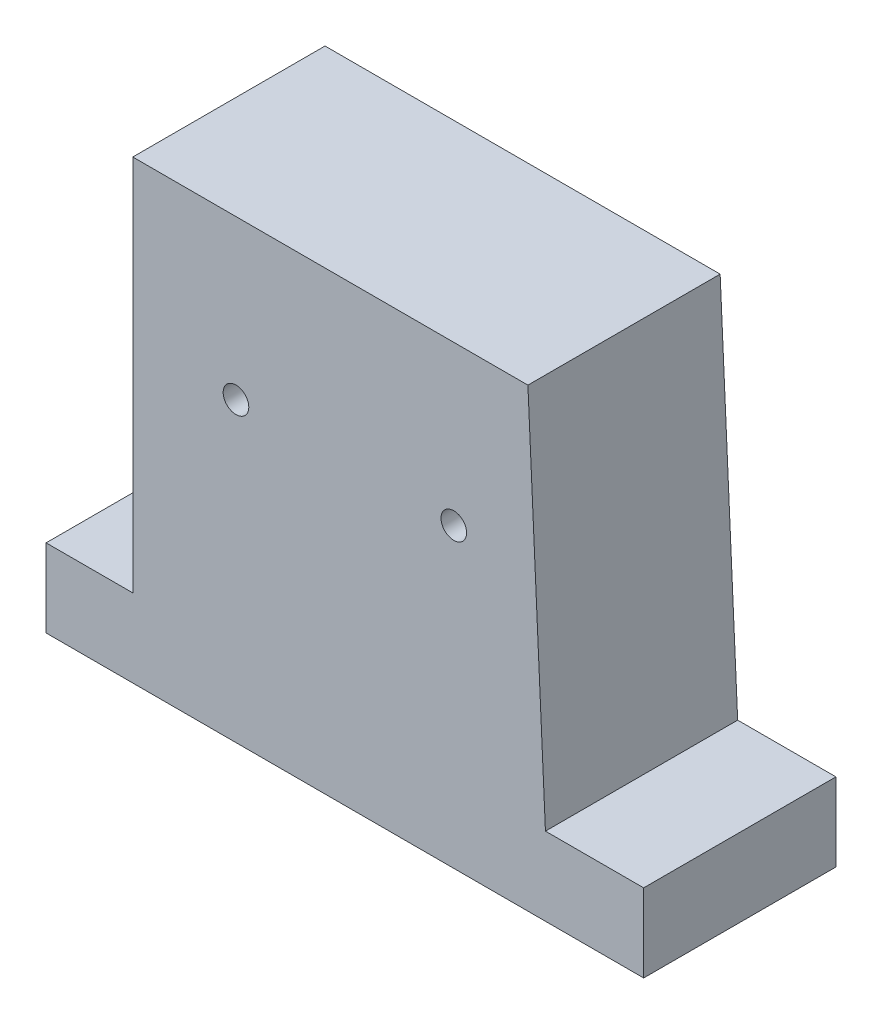
ISO-10303-21;
HEADER;
FILE_DESCRIPTION(('STEP AP214'),'2;1');
FILE_NAME('part.step','',(''),(''),'','','');
FILE_SCHEMA(('AUTOMOTIVE_DESIGN { 1 0 10303 214 1 1 1 1 }'));
ENDSEC;
DATA;
#1=APPLICATION_CONTEXT('core data for automotive mechanical design processes');
#2=APPLICATION_PROTOCOL_DEFINITION('international standard','automotive_design',2000,#1);
#3=PRODUCT_CONTEXT('',#1,'mechanical');
#4=PRODUCT('Part','Part','',(#3));
#5=PRODUCT_RELATED_PRODUCT_CATEGORY('part','',(#4));
#6=PRODUCT_DEFINITION_FORMATION('','',#4);
#7=PRODUCT_DEFINITION_CONTEXT('part definition',#1,'design');
#8=PRODUCT_DEFINITION('design','',#6,#7);
#9=PRODUCT_DEFINITION_SHAPE('','',#8);
#10=(LENGTH_UNIT() NAMED_UNIT(*) SI_UNIT(.MILLI.,.METRE.));
#11=(NAMED_UNIT(*) PLANE_ANGLE_UNIT() SI_UNIT($,.RADIAN.));
#12=(NAMED_UNIT(*) SI_UNIT($,.STERADIAN.) SOLID_ANGLE_UNIT());
#13=UNCERTAINTY_MEASURE_WITH_UNIT(LENGTH_MEASURE(1.E-05),#10,'distance_accuracy_value','');
#14=(GEOMETRIC_REPRESENTATION_CONTEXT(3) GLOBAL_UNCERTAINTY_ASSIGNED_CONTEXT((#13)) GLOBAL_UNIT_ASSIGNED_CONTEXT((#10,
#11,#12)) REPRESENTATION_CONTEXT('',''));
#15=CARTESIAN_POINT('',(0.,0.,0.));
#16=DIRECTION('',(0.,0.,1.));
#17=DIRECTION('',(1.,0.,0.));
#18=AXIS2_PLACEMENT_3D('',#15,#16,#17);
#19=CARTESIAN_POINT('',(0.,0.,60.));
#20=DIRECTION('',(0.,0.,-1.));
#21=DIRECTION('',(-1.,0.,0.));
#22=AXIS2_PLACEMENT_3D('',#19,#20,#21);
#23=PLANE('',#22);
#24=DIRECTION('',(1.,0.,0.));
#25=VECTOR('',#24,1.);
#26=CARTESIAN_POINT('',(-55.837306641314,-31.0846861714532,60.));
#27=LINE('',#26,#25);
#28=CARTESIAN_POINT('',(-105.534428359872,-31.0846861714532,60.));
#29=VERTEX_POINT('',#28);
#30=CARTESIAN_POINT('',(80.9736886688471,-31.0846861714532,60.));
#31=VERTEX_POINT('',#30);
#32=EDGE_CURVE('E52',#29,#31,#27,.T.);
#33=ORIENTED_EDGE('',*,*,#32,.T.);
#34=DIRECTION('',(0.,1.,0.));
#35=VECTOR('',#34,1.);
#36=CARTESIAN_POINT('',(80.9736886688471,-6.71582725928488,60.));
#37=LINE('',#36,#35);
#38=CARTESIAN_POINT('',(80.9736886688471,-6.71582725928488,60.));
#39=VERTEX_POINT('',#38);
#40=EDGE_CURVE('E181',#31,#39,#37,.T.);
#41=ORIENTED_EDGE('',*,*,#40,.T.);
#42=DIRECTION('',(-1.,0.,0.));
#43=VECTOR('',#42,1.);
#44=CARTESIAN_POINT('',(50.3153370961016,-6.71582725928488,60.));
#45=LINE('',#44,#43);
#46=CARTESIAN_POINT('',(50.3153370961016,-6.71582725928488,60.));
#47=VERTEX_POINT('',#46);
#48=EDGE_CURVE('E161',#39,#47,#45,.T.);
#49=ORIENTED_EDGE('',*,*,#48,.T.);
#50=DIRECTION('',(-0.0463894137706844,0.998923431645295,0.));
#51=VECTOR('',#50,1.);
#52=CARTESIAN_POINT('',(50.3153370961016,-6.71582725928488,60.));
#53=LINE('',#52,#51);
#54=CARTESIAN_POINT('',(44.8437730573466,111.105741969386,60.));
#55=VERTEX_POINT('',#54);
#56=EDGE_CURVE('E177',#47,#55,#53,.T.);
#57=ORIENTED_EDGE('',*,*,#56,.T.);
#58=DIRECTION('',(-1.,0.,0.));
#59=VECTOR('',#58,1.);
#60=CARTESIAN_POINT('',(-78.4773436223531,111.105741969386,60.));
#61=LINE('',#60,#59);
#62=CARTESIAN_POINT('',(-78.4773436223531,111.105741969386,60.));
#63=VERTEX_POINT('',#62);
#64=EDGE_CURVE('E112',#55,#63,#61,.T.);
#65=ORIENTED_EDGE('',*,*,#64,.T.);
#66=DIRECTION('',(0.,-1.,0.));
#67=VECTOR('',#66,1.);
#68=CARTESIAN_POINT('',(-78.4773436223531,-6.71582725926458,60.));
#69=LINE('',#68,#67);
#70=CARTESIAN_POINT('',(-78.4773436223531,-6.71582725926458,60.));
#71=VERTEX_POINT('',#70);
#72=EDGE_CURVE('E106',#63,#71,#69,.T.);
#73=ORIENTED_EDGE('',*,*,#72,.T.);
#74=DIRECTION('',(-1.,0.,0.));
#75=VECTOR('',#74,1.);
#76=CARTESIAN_POINT('',(-78.4773436223531,-6.71582725926458,60.));
#77=LINE('',#76,#75);
#78=CARTESIAN_POINT('',(-105.534428359872,-6.71582725926458,60.));
#79=VERTEX_POINT('',#78);
#80=EDGE_CURVE('E110',#71,#79,#77,.T.);
#81=ORIENTED_EDGE('',*,*,#80,.T.);
#82=DIRECTION('',(0.,-1.,0.));
#83=VECTOR('',#82,1.);
#84=CARTESIAN_POINT('',(-105.534428359872,-6.71582725926458,60.));
#85=LINE('',#84,#83);
#86=EDGE_CURVE('E126',#79,#29,#85,.T.);
#87=ORIENTED_EDGE('',*,*,#86,.T.);
#88=EDGE_LOOP('',(#33,#41,#49,#57,#65,#73,#81,#87));
#89=FACE_BOUND('',#88,.T.);
#90=CARTESIAN_POINT('',(-46.2713659081402,61.5865207292527,60.));
#91=DIRECTION('',(0.,0.,1.));
#92=DIRECTION('',(1.,0.,0.));
#93=AXIS2_PLACEMENT_3D('',#90,#91,#92);
#94=CIRCLE('',#93,4.00000000000001);
#95=CARTESIAN_POINT('',(-42.2713659081402,61.5865207292527,60.));
#96=VERTEX_POINT('',#95);
#97=EDGE_CURVE('E135',#96,#96,#94,.T.);
#98=ORIENTED_EDGE('',*,*,#97,.F.);
#99=EDGE_LOOP('',(#98));
#100=FACE_BOUND('',#99,.T.);
#101=CARTESIAN_POINT('',(21.7106262171154,61.5865207292527,60.));
#102=DIRECTION('',(0.,0.,1.));
#103=DIRECTION('',(-1.,0.,0.));
#104=AXIS2_PLACEMENT_3D('',#101,#102,#103);
#105=CIRCLE('',#104,4.00000000000001);
#106=CARTESIAN_POINT('',(17.7106262171154,61.5865207292527,60.));
#107=VERTEX_POINT('',#106);
#108=EDGE_CURVE('E187',#107,#107,#105,.T.);
#109=ORIENTED_EDGE('',*,*,#108,.F.);
#110=EDGE_LOOP('',(#109));
#111=FACE_BOUND('',#110,.T.);
#112=ADVANCED_FACE('F35',(#89,#100,#111),#23,.F.);
#113=CARTESIAN_POINT('',(0.,0.,0.));
#114=DIRECTION('',(0.,0.,-1.));
#115=DIRECTION('',(-1.,0.,0.));
#116=AXIS2_PLACEMENT_3D('',#113,#114,#115);
#117=PLANE('',#116);
#118=CARTESIAN_POINT('',(-46.2713659081402,61.5865207292527,0.));
#119=DIRECTION('',(0.,0.,1.));
#120=DIRECTION('',(1.,0.,0.));
#121=AXIS2_PLACEMENT_3D('',#118,#119,#120);
#122=CIRCLE('',#121,4.00000000000001);
#123=CARTESIAN_POINT('',(-42.2713659081402,61.5865207292527,0.));
#124=VERTEX_POINT('',#123);
#125=EDGE_CURVE('E184',#124,#124,#122,.T.);
#126=ORIENTED_EDGE('',*,*,#125,.T.);
#127=EDGE_LOOP('',(#126));
#128=FACE_BOUND('',#127,.T.);
#129=DIRECTION('',(0.,1.,0.));
#130=VECTOR('',#129,1.);
#131=CARTESIAN_POINT('',(80.9736886688471,-6.71582725928488,0.));
#132=LINE('',#131,#130);
#133=CARTESIAN_POINT('',(80.9736886688471,-31.0846861714532,0.));
#134=VERTEX_POINT('',#133);
#135=CARTESIAN_POINT('',(80.9736886688471,-6.71582725928488,0.));
#136=VERTEX_POINT('',#135);
#137=EDGE_CURVE('E132',#134,#136,#132,.T.);
#138=ORIENTED_EDGE('',*,*,#137,.F.);
#139=DIRECTION('',(1.,0.,0.));
#140=VECTOR('',#139,1.);
#141=CARTESIAN_POINT('',(-55.837306641314,-31.0846861714532,0.));
#142=LINE('',#141,#140);
#143=CARTESIAN_POINT('',(-105.534428359872,-31.0846861714532,0.));
#144=VERTEX_POINT('',#143);
#145=EDGE_CURVE('E144',#144,#134,#142,.T.);
#146=ORIENTED_EDGE('',*,*,#145,.F.);
#147=DIRECTION('',(0.,-1.,0.));
#148=VECTOR('',#147,1.);
#149=CARTESIAN_POINT('',(-105.534428359872,-6.71582725926458,0.));
#150=LINE('',#149,#148);
#151=CARTESIAN_POINT('',(-105.534428359872,-6.71582725926458,0.));
#152=VERTEX_POINT('',#151);
#153=EDGE_CURVE('E89',#152,#144,#150,.T.);
#154=ORIENTED_EDGE('',*,*,#153,.F.);
#155=DIRECTION('',(-1.,0.,0.));
#156=VECTOR('',#155,1.);
#157=CARTESIAN_POINT('',(-78.4773436223531,-6.71582725926458,0.));
#158=LINE('',#157,#156);
#159=CARTESIAN_POINT('',(-78.4773436223531,-6.71582725926458,0.));
#160=VERTEX_POINT('',#159);
#161=EDGE_CURVE('E82',#160,#152,#158,.T.);
#162=ORIENTED_EDGE('',*,*,#161,.F.);
#163=DIRECTION('',(0.,-1.,0.));
#164=VECTOR('',#163,1.);
#165=CARTESIAN_POINT('',(-78.4773436223531,-6.71582725926458,0.));
#166=LINE('',#165,#164);
#167=CARTESIAN_POINT('',(-78.4773436223531,111.105741969386,0.));
#168=VERTEX_POINT('',#167);
#169=EDGE_CURVE('E120',#168,#160,#166,.T.);
#170=ORIENTED_EDGE('',*,*,#169,.F.);
#171=DIRECTION('',(-1.,0.,0.));
#172=VECTOR('',#171,1.);
#173=CARTESIAN_POINT('',(-78.4773436223531,111.105741969386,0.));
#174=LINE('',#173,#172);
#175=CARTESIAN_POINT('',(44.8437730573466,111.105741969386,0.));
#176=VERTEX_POINT('',#175);
#177=EDGE_CURVE('E139',#176,#168,#174,.T.);
#178=ORIENTED_EDGE('',*,*,#177,.F.);
#179=DIRECTION('',(-0.0463894137706844,0.998923431645295,0.));
#180=VECTOR('',#179,1.);
#181=CARTESIAN_POINT('',(50.3153370961016,-6.71582725928488,0.));
#182=LINE('',#181,#180);
#183=CARTESIAN_POINT('',(50.3153370961016,-6.71582725928488,0.));
#184=VERTEX_POINT('',#183);
#185=EDGE_CURVE('E137',#184,#176,#182,.T.);
#186=ORIENTED_EDGE('',*,*,#185,.F.);
#187=DIRECTION('',(-1.,0.,0.));
#188=VECTOR('',#187,1.);
#189=CARTESIAN_POINT('',(50.3153370961016,-6.71582725928488,0.));
#190=LINE('',#189,#188);
#191=EDGE_CURVE('E134',#136,#184,#190,.T.);
#192=ORIENTED_EDGE('',*,*,#191,.F.);
#193=EDGE_LOOP('',(#138,#146,#154,#162,#170,#178,#186,#192));
#194=FACE_BOUND('',#193,.T.);
#195=CARTESIAN_POINT('',(21.7106262171154,61.5865207292527,0.));
#196=DIRECTION('',(0.,0.,1.));
#197=DIRECTION('',(-1.,0.,0.));
#198=AXIS2_PLACEMENT_3D('',#195,#196,#197);
#199=CIRCLE('',#198,4.00000000000001);
#200=CARTESIAN_POINT('',(17.7106262171154,61.5865207292527,0.));
#201=VERTEX_POINT('',#200);
#202=EDGE_CURVE('E190',#201,#201,#199,.T.);
#203=ORIENTED_EDGE('',*,*,#202,.T.);
#204=EDGE_LOOP('',(#203));
#205=FACE_BOUND('',#204,.T.);
#206=ADVANCED_FACE('F167',(#128,#194,#205),#117,.T.);
#207=CARTESIAN_POINT('',(80.9736886688471,-6.71582725928488,60.));
#208=DIRECTION('',(-1.,0.,0.));
#209=DIRECTION('',(0.,0.,1.));
#210=AXIS2_PLACEMENT_3D('',#207,#208,#209);
#211=PLANE('',#210);
#212=ORIENTED_EDGE('',*,*,#137,.T.);
#213=DIRECTION('',(0.,0.,-1.));
#214=VECTOR('',#213,1.);
#215=CARTESIAN_POINT('',(80.9736886688471,-6.71582725928488,60.));
#216=LINE('',#215,#214);
#217=EDGE_CURVE('E44',#39,#136,#216,.T.);
#218=ORIENTED_EDGE('',*,*,#217,.F.);
#219=ORIENTED_EDGE('',*,*,#40,.F.);
#220=DIRECTION('',(0.,0.,-1.));
#221=VECTOR('',#220,1.);
#222=CARTESIAN_POINT('',(80.9736886688471,-31.0846861714532,60.));
#223=LINE('',#222,#221);
#224=EDGE_CURVE('E11',#31,#134,#223,.T.);
#225=ORIENTED_EDGE('',*,*,#224,.T.);
#226=EDGE_LOOP('',(#212,#218,#219,#225));
#227=FACE_BOUND('',#226,.T.);
#228=ADVANCED_FACE('F37',(#227),#211,.F.);
#229=CARTESIAN_POINT('',(50.3153370961016,-6.71582725928488,60.));
#230=DIRECTION('',(0.,-1.,0.));
#231=DIRECTION('',(0.,0.,-1.));
#232=AXIS2_PLACEMENT_3D('',#229,#230,#231);
#233=PLANE('',#232);
#234=ORIENTED_EDGE('',*,*,#191,.T.);
#235=DIRECTION('',(0.,0.,-1.));
#236=VECTOR('',#235,1.);
#237=CARTESIAN_POINT('',(50.3153370961016,-6.71582725928488,60.));
#238=LINE('',#237,#236);
#239=EDGE_CURVE('E152',#47,#184,#238,.T.);
#240=ORIENTED_EDGE('',*,*,#239,.F.);
#241=ORIENTED_EDGE('',*,*,#48,.F.);
#242=ORIENTED_EDGE('',*,*,#217,.T.);
#243=EDGE_LOOP('',(#234,#240,#241,#242));
#244=FACE_BOUND('',#243,.T.);
#245=ADVANCED_FACE('F159',(#244),#233,.F.);
#246=CARTESIAN_POINT('',(50.3153370961016,-6.71582725928488,60.));
#247=DIRECTION('',(-0.998923431645295,-0.0463894137706844,0.));
#248=DIRECTION('',(0.0463894137706844,-0.998923431645295,0.));
#249=AXIS2_PLACEMENT_3D('',#246,#247,#248);
#250=PLANE('',#249);
#251=ORIENTED_EDGE('',*,*,#185,.T.);
#252=DIRECTION('',(0.,0.,-1.));
#253=VECTOR('',#252,1.);
#254=CARTESIAN_POINT('',(44.8437730573466,111.105741969386,60.));
#255=LINE('',#254,#253);
#256=EDGE_CURVE('E149',#55,#176,#255,.T.);
#257=ORIENTED_EDGE('',*,*,#256,.F.);
#258=ORIENTED_EDGE('',*,*,#56,.F.);
#259=ORIENTED_EDGE('',*,*,#239,.T.);
#260=EDGE_LOOP('',(#251,#257,#258,#259));
#261=FACE_BOUND('',#260,.T.);
#262=ADVANCED_FACE('F173',(#261),#250,.F.);
#263=CARTESIAN_POINT('',(-78.4773436223531,111.105741969386,60.));
#264=DIRECTION('',(0.,-1.,0.));
#265=DIRECTION('',(0.,0.,-1.));
#266=AXIS2_PLACEMENT_3D('',#263,#264,#265);
#267=PLANE('',#266);
#268=ORIENTED_EDGE('',*,*,#177,.T.);
#269=DIRECTION('',(0.,0.,-1.));
#270=VECTOR('',#269,1.);
#271=CARTESIAN_POINT('',(-78.4773436223531,111.105741969386,60.));
#272=LINE('',#271,#270);
#273=EDGE_CURVE('E121',#63,#168,#272,.T.);
#274=ORIENTED_EDGE('',*,*,#273,.F.);
#275=ORIENTED_EDGE('',*,*,#64,.F.);
#276=ORIENTED_EDGE('',*,*,#256,.T.);
#277=EDGE_LOOP('',(#268,#274,#275,#276));
#278=FACE_BOUND('',#277,.T.);
#279=ADVANCED_FACE('F176',(#278),#267,.F.);
#280=CARTESIAN_POINT('',(-78.4773436223531,-6.71582725926458,60.));
#281=DIRECTION('',(1.,0.,0.));
#282=DIRECTION('',(0.,0.,-1.));
#283=AXIS2_PLACEMENT_3D('',#280,#281,#282);
#284=PLANE('',#283);
#285=ORIENTED_EDGE('',*,*,#169,.T.);
#286=DIRECTION('',(0.,0.,-1.));
#287=VECTOR('',#286,1.);
#288=CARTESIAN_POINT('',(-78.4773436223531,-6.71582725926458,60.));
#289=LINE('',#288,#287);
#290=EDGE_CURVE('E117',#71,#160,#289,.T.);
#291=ORIENTED_EDGE('',*,*,#290,.F.);
#292=ORIENTED_EDGE('',*,*,#72,.F.);
#293=ORIENTED_EDGE('',*,*,#273,.T.);
#294=EDGE_LOOP('',(#285,#291,#292,#293));
#295=FACE_BOUND('',#294,.T.);
#296=ADVANCED_FACE('F118',(#295),#284,.F.);
#297=CARTESIAN_POINT('',(-78.4773436223531,-6.71582725926458,60.));
#298=DIRECTION('',(0.,-1.,0.));
#299=DIRECTION('',(0.,0.,-1.));
#300=AXIS2_PLACEMENT_3D('',#297,#298,#299);
#301=PLANE('',#300);
#302=ORIENTED_EDGE('',*,*,#161,.T.);
#303=DIRECTION('',(0.,0.,-1.));
#304=VECTOR('',#303,1.);
#305=CARTESIAN_POINT('',(-105.534428359872,-6.71582725926458,60.));
#306=LINE('',#305,#304);
#307=EDGE_CURVE('E122',#79,#152,#306,.T.);
#308=ORIENTED_EDGE('',*,*,#307,.F.);
#309=ORIENTED_EDGE('',*,*,#80,.F.);
#310=ORIENTED_EDGE('',*,*,#290,.T.);
#311=EDGE_LOOP('',(#302,#308,#309,#310));
#312=FACE_BOUND('',#311,.T.);
#313=ADVANCED_FACE('F124',(#312),#301,.F.);
#314=CARTESIAN_POINT('',(-105.534428359872,-6.71582725926458,60.));
#315=DIRECTION('',(1.,0.,0.));
#316=DIRECTION('',(0.,0.,-1.));
#317=AXIS2_PLACEMENT_3D('',#314,#315,#316);
#318=PLANE('',#317);
#319=ORIENTED_EDGE('',*,*,#153,.T.);
#320=DIRECTION('',(0.,0.,-1.));
#321=VECTOR('',#320,1.);
#322=CARTESIAN_POINT('',(-105.534428359872,-31.0846861714532,60.));
#323=LINE('',#322,#321);
#324=EDGE_CURVE('E128',#29,#144,#323,.T.);
#325=ORIENTED_EDGE('',*,*,#324,.F.);
#326=ORIENTED_EDGE('',*,*,#86,.F.);
#327=ORIENTED_EDGE('',*,*,#307,.T.);
#328=EDGE_LOOP('',(#319,#325,#326,#327));
#329=FACE_BOUND('',#328,.T.);
#330=ADVANCED_FACE('F213',(#329),#318,.F.);
#331=CARTESIAN_POINT('',(-55.837306641314,-31.0846861714532,60.));
#332=DIRECTION('',(0.,1.,0.));
#333=DIRECTION('',(0.,0.,1.));
#334=AXIS2_PLACEMENT_3D('',#331,#332,#333);
#335=PLANE('',#334);
#336=ORIENTED_EDGE('',*,*,#145,.T.);
#337=ORIENTED_EDGE('',*,*,#224,.F.);
#338=ORIENTED_EDGE('',*,*,#32,.F.);
#339=ORIENTED_EDGE('',*,*,#324,.T.);
#340=EDGE_LOOP('',(#336,#337,#338,#339));
#341=FACE_BOUND('',#340,.T.);
#342=ADVANCED_FACE('F210',(#341),#335,.F.);
#343=CARTESIAN_POINT('',(-46.2713659081402,61.5865207292527,60.));
#344=DIRECTION('',(0.,0.,-1.));
#345=DIRECTION('',(-1.,0.,0.));
#346=AXIS2_PLACEMENT_3D('',#343,#344,#345);
#347=CYLINDRICAL_SURFACE('',#346,4.00000000000001);
#348=ORIENTED_EDGE('',*,*,#97,.T.);
#349=EDGE_LOOP('',(#348));
#350=FACE_BOUND('',#349,.T.);
#351=ORIENTED_EDGE('',*,*,#125,.F.);
#352=EDGE_LOOP('',(#351));
#353=FACE_BOUND('',#352,.T.);
#354=ADVANCED_FACE('F207',(#350,#353),#347,.F.);
#355=CARTESIAN_POINT('',(21.7106262171154,61.5865207292527,60.));
#356=DIRECTION('',(0.,0.,-1.));
#357=DIRECTION('',(-1.,0.,0.));
#358=AXIS2_PLACEMENT_3D('',#355,#356,#357);
#359=CYLINDRICAL_SURFACE('',#358,4.00000000000001);
#360=ORIENTED_EDGE('',*,*,#108,.T.);
#361=EDGE_LOOP('',(#360));
#362=FACE_BOUND('',#361,.T.);
#363=ORIENTED_EDGE('',*,*,#202,.F.);
#364=EDGE_LOOP('',(#363));
#365=FACE_BOUND('',#364,.T.);
#366=ADVANCED_FACE('F196',(#362,#365),#359,.F.);
#367=CLOSED_SHELL('',(#112,#206,#228,#245,#262,#279,#296,#313,#330,#342,#354,#366));
#368=MANIFOLD_SOLID_BREP('B2',#367);
#369=ADVANCED_BREP_SHAPE_REPRESENTATION('',(#18,#368),#14);
#370=SHAPE_DEFINITION_REPRESENTATION(#9,#369);
ENDSEC;
END-ISO-10303-21;
